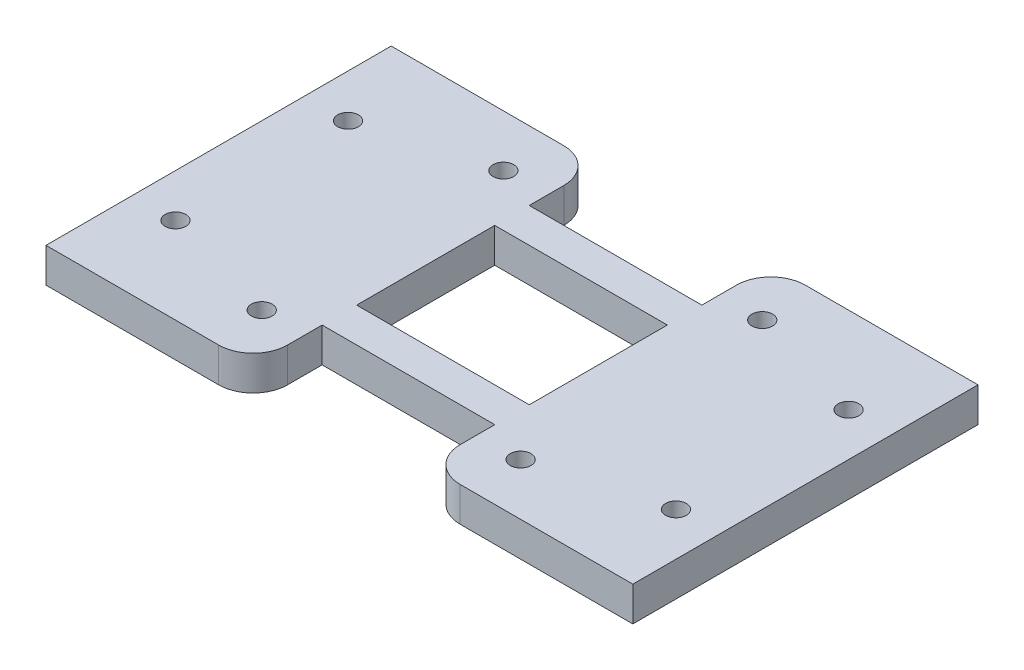
ISO-10303-21;
HEADER;
FILE_DESCRIPTION(('STEP AP214'),'2;1');
FILE_NAME('part.step','',(''),(''),'','','');
FILE_SCHEMA(('AUTOMOTIVE_DESIGN { 1 0 10303 214 1 1 1 1 }'));
ENDSEC;
DATA;
#1=APPLICATION_CONTEXT('core data for automotive mechanical design processes');
#2=APPLICATION_PROTOCOL_DEFINITION('international standard','automotive_design',2000,#1);
#3=PRODUCT_CONTEXT('',#1,'mechanical');
#4=PRODUCT('Part','Part','',(#3));
#5=PRODUCT_RELATED_PRODUCT_CATEGORY('part','',(#4));
#6=PRODUCT_DEFINITION_FORMATION('','',#4);
#7=PRODUCT_DEFINITION_CONTEXT('part definition',#1,'design');
#8=PRODUCT_DEFINITION('design','',#6,#7);
#9=PRODUCT_DEFINITION_SHAPE('','',#8);
#10=(LENGTH_UNIT() NAMED_UNIT(*) SI_UNIT(.MILLI.,.METRE.));
#11=(NAMED_UNIT(*) PLANE_ANGLE_UNIT() SI_UNIT($,.RADIAN.));
#12=(NAMED_UNIT(*) SI_UNIT($,.STERADIAN.) SOLID_ANGLE_UNIT());
#13=UNCERTAINTY_MEASURE_WITH_UNIT(LENGTH_MEASURE(1.E-05),#10,'distance_accuracy_value','');
#14=(GEOMETRIC_REPRESENTATION_CONTEXT(3) GLOBAL_UNCERTAINTY_ASSIGNED_CONTEXT((#13)) GLOBAL_UNIT_ASSIGNED_CONTEXT((#10,
#11,#12)) REPRESENTATION_CONTEXT('',''));
#15=CARTESIAN_POINT('',(0.,0.,0.));
#16=DIRECTION('',(0.,0.,1.));
#17=DIRECTION('',(1.,0.,0.));
#18=AXIS2_PLACEMENT_3D('',#15,#16,#17);
#19=CARTESIAN_POINT('',(17.,-2.,10.));
#20=DIRECTION('',(0.,1.,0.));
#21=DIRECTION('',(-1.,0.,0.));
#22=AXIS2_PLACEMENT_3D('',#19,#20,#21);
#23=PLANE('',#22);
#24=CARTESIAN_POINT('',(-7.5,-2.,-7.));
#25=DIRECTION('',(0.,-1.,0.));
#26=DIRECTION('',(-1.,0.,0.));
#27=AXIS2_PLACEMENT_3D('',#24,#25,#26);
#28=CIRCLE('',#27,0.6);
#29=CARTESIAN_POINT('',(-8.1,-2.,-7.));
#30=VERTEX_POINT('',#29);
#31=EDGE_CURVE('E658',#30,#30,#28,.T.);
#32=ORIENTED_EDGE('',*,*,#31,.F.);
#33=EDGE_LOOP('',(#32));
#34=FACE_BOUND('',#33,.T.);
#35=CARTESIAN_POINT('',(-14.5,-2.,-5.));
#36=DIRECTION('',(0.,-1.,0.));
#37=DIRECTION('',(-1.,0.,0.));
#38=AXIS2_PLACEMENT_3D('',#35,#36,#37);
#39=CIRCLE('',#38,0.6);
#40=CARTESIAN_POINT('',(-15.1,-2.,-5.));
#41=VERTEX_POINT('',#40);
#42=EDGE_CURVE('E660',#41,#41,#39,.T.);
#43=ORIENTED_EDGE('',*,*,#42,.F.);
#44=EDGE_LOOP('',(#43));
#45=FACE_BOUND('',#44,.T.);
#46=CARTESIAN_POINT('',(-14.5,-2.,5.));
#47=DIRECTION('',(0.,-1.,0.));
#48=DIRECTION('',(1.,0.,0.));
#49=AXIS2_PLACEMENT_3D('',#46,#47,#48);
#50=CIRCLE('',#49,0.6);
#51=CARTESIAN_POINT('',(-13.9,-2.,5.));
#52=VERTEX_POINT('',#51);
#53=EDGE_CURVE('E666',#52,#52,#50,.T.);
#54=ORIENTED_EDGE('',*,*,#53,.F.);
#55=EDGE_LOOP('',(#54));
#56=FACE_BOUND('',#55,.T.);
#57=CARTESIAN_POINT('',(-7.5,-2.,7.));
#58=DIRECTION('',(0.,-1.,0.));
#59=DIRECTION('',(1.,0.,0.));
#60=AXIS2_PLACEMENT_3D('',#57,#58,#59);
#61=CIRCLE('',#60,0.6);
#62=CARTESIAN_POINT('',(-6.9,-2.,7.));
#63=VERTEX_POINT('',#62);
#64=EDGE_CURVE('E354',#63,#63,#61,.T.);
#65=ORIENTED_EDGE('',*,*,#64,.F.);
#66=EDGE_LOOP('',(#65));
#67=FACE_BOUND('',#66,.T.);
#68=CARTESIAN_POINT('',(14.5,-2.,5.));
#69=DIRECTION('',(0.,1.,0.));
#70=DIRECTION('',(1.,0.,0.));
#71=AXIS2_PLACEMENT_3D('',#68,#69,#70);
#72=CIRCLE('',#71,0.6);
#73=CARTESIAN_POINT('',(15.1,-2.,5.));
#74=VERTEX_POINT('',#73);
#75=EDGE_CURVE('E351',#74,#74,#72,.T.);
#76=ORIENTED_EDGE('',*,*,#75,.T.);
#77=EDGE_LOOP('',(#76));
#78=FACE_BOUND('',#77,.T.);
#79=CARTESIAN_POINT('',(7.5,-2.,-7.));
#80=DIRECTION('',(0.,1.,0.));
#81=DIRECTION('',(-1.,0.,0.));
#82=AXIS2_PLACEMENT_3D('',#79,#80,#81);
#83=CIRCLE('',#82,0.600000000000001);
#84=CARTESIAN_POINT('',(6.9,-2.,-7.));
#85=VERTEX_POINT('',#84);
#86=EDGE_CURVE('E202',#85,#85,#83,.T.);
#87=ORIENTED_EDGE('',*,*,#86,.T.);
#88=EDGE_LOOP('',(#87));
#89=FACE_BOUND('',#88,.T.);
#90=DIRECTION('',(1.,0.,0.));
#91=VECTOR('',#90,1.);
#92=CARTESIAN_POINT('',(-17.,-2.,-10.));
#93=LINE('',#92,#91);
#94=CARTESIAN_POINT('',(-17.,-2.,-10.));
#95=VERTEX_POINT('',#94);
#96=CARTESIAN_POINT('',(-7.,-2.,-10.));
#97=VERTEX_POINT('',#96);
#98=EDGE_CURVE('E216',#95,#97,#93,.T.);
#99=ORIENTED_EDGE('',*,*,#98,.T.);
#100=CARTESIAN_POINT('',(-7.,-2.,-8.));
#101=DIRECTION('',(0.,1.,0.));
#102=DIRECTION('',(-1.,0.,0.));
#103=AXIS2_PLACEMENT_3D('',#100,#101,#102);
#104=CIRCLE('',#103,2.);
#105=CARTESIAN_POINT('',(-5.,-2.,-8.));
#106=VERTEX_POINT('',#105);
#107=EDGE_CURVE('E316',#97,#106,#104,.F.);
#108=ORIENTED_EDGE('',*,*,#107,.T.);
#109=DIRECTION('',(0.,0.,-1.));
#110=VECTOR('',#109,1.);
#111=CARTESIAN_POINT('',(-5.,-2.,10.));
#112=LINE('',#111,#110);
#113=CARTESIAN_POINT('',(-5.,-2.,-6.));
#114=VERTEX_POINT('',#113);
#115=EDGE_CURVE('E235',#114,#106,#112,.T.);
#116=ORIENTED_EDGE('',*,*,#115,.F.);
#117=DIRECTION('',(-1.,0.,0.));
#118=VECTOR('',#117,1.);
#119=CARTESIAN_POINT('',(6.,-2.,-6.));
#120=LINE('',#119,#118);
#121=CARTESIAN_POINT('',(5.,-2.,-6.));
#122=VERTEX_POINT('',#121);
#123=EDGE_CURVE('E241',#122,#114,#120,.T.);
#124=ORIENTED_EDGE('',*,*,#123,.F.);
#125=DIRECTION('',(0.,0.,-1.));
#126=VECTOR('',#125,1.);
#127=CARTESIAN_POINT('',(5.,-2.,10.));
#128=LINE('',#127,#126);
#129=CARTESIAN_POINT('',(5.,-2.,-8.));
#130=VERTEX_POINT('',#129);
#131=EDGE_CURVE('E281',#122,#130,#128,.T.);
#132=ORIENTED_EDGE('',*,*,#131,.T.);
#133=CARTESIAN_POINT('',(7.,-2.,-8.));
#134=DIRECTION('',(0.,1.,0.));
#135=DIRECTION('',(-1.,0.,0.));
#136=AXIS2_PLACEMENT_3D('',#133,#134,#135);
#137=CIRCLE('',#136,2.);
#138=CARTESIAN_POINT('',(7.,-2.,-10.));
#139=VERTEX_POINT('',#138);
#140=EDGE_CURVE('E291',#130,#139,#137,.F.);
#141=ORIENTED_EDGE('',*,*,#140,.T.);
#142=DIRECTION('',(1.,0.,0.));
#143=VECTOR('',#142,1.);
#144=CARTESIAN_POINT('',(17.,-2.,-10.));
#145=LINE('',#144,#143);
#146=CARTESIAN_POINT('',(17.,-2.,-10.));
#147=VERTEX_POINT('',#146);
#148=EDGE_CURVE('E258',#139,#147,#145,.T.);
#149=ORIENTED_EDGE('',*,*,#148,.T.);
#150=DIRECTION('',(0.,0.,-1.));
#151=VECTOR('',#150,1.);
#152=CARTESIAN_POINT('',(17.,-2.,10.));
#153=LINE('',#152,#151);
#154=CARTESIAN_POINT('',(17.,-2.,10.));
#155=VERTEX_POINT('',#154);
#156=EDGE_CURVE('E278',#155,#147,#153,.T.);
#157=ORIENTED_EDGE('',*,*,#156,.F.);
#158=DIRECTION('',(1.,0.,0.));
#159=VECTOR('',#158,1.);
#160=CARTESIAN_POINT('',(17.,-2.,10.));
#161=LINE('',#160,#159);
#162=CARTESIAN_POINT('',(7.,-2.,10.));
#163=VERTEX_POINT('',#162);
#164=EDGE_CURVE('E259',#163,#155,#161,.T.);
#165=ORIENTED_EDGE('',*,*,#164,.F.);
#166=CARTESIAN_POINT('',(7.,-2.,8.));
#167=DIRECTION('',(0.,1.,0.));
#168=DIRECTION('',(-1.,0.,0.));
#169=AXIS2_PLACEMENT_3D('',#166,#167,#168);
#170=CIRCLE('',#169,2.);
#171=CARTESIAN_POINT('',(5.,-2.,8.));
#172=VERTEX_POINT('',#171);
#173=EDGE_CURVE('E293',#163,#172,#170,.F.);
#174=ORIENTED_EDGE('',*,*,#173,.T.);
#175=CARTESIAN_POINT('',(5.,-2.,6.));
#176=VERTEX_POINT('',#175);
#177=EDGE_CURVE('E282',#172,#176,#128,.T.);
#178=ORIENTED_EDGE('',*,*,#177,.T.);
#179=DIRECTION('',(-1.,0.,0.));
#180=VECTOR('',#179,1.);
#181=CARTESIAN_POINT('',(6.,-2.,6.));
#182=LINE('',#181,#180);
#183=CARTESIAN_POINT('',(-5.,-2.,6.));
#184=VERTEX_POINT('',#183);
#185=EDGE_CURVE('E199',#176,#184,#182,.T.);
#186=ORIENTED_EDGE('',*,*,#185,.T.);
#187=CARTESIAN_POINT('',(-5.,-2.,8.));
#188=VERTEX_POINT('',#187);
#189=EDGE_CURVE('E236',#188,#184,#112,.T.);
#190=ORIENTED_EDGE('',*,*,#189,.F.);
#191=CARTESIAN_POINT('',(-7.,-2.,8.));
#192=DIRECTION('',(0.,1.,0.));
#193=DIRECTION('',(-1.,0.,0.));
#194=AXIS2_PLACEMENT_3D('',#191,#192,#193);
#195=CIRCLE('',#194,2.);
#196=CARTESIAN_POINT('',(-7.,-2.,10.));
#197=VERTEX_POINT('',#196);
#198=EDGE_CURVE('E48',#188,#197,#195,.F.);
#199=ORIENTED_EDGE('',*,*,#198,.T.);
#200=DIRECTION('',(1.,0.,0.));
#201=VECTOR('',#200,1.);
#202=CARTESIAN_POINT('',(-17.,-2.,10.));
#203=LINE('',#202,#201);
#204=CARTESIAN_POINT('',(-17.,-2.,10.));
#205=VERTEX_POINT('',#204);
#206=EDGE_CURVE('E217',#205,#197,#203,.T.);
#207=ORIENTED_EDGE('',*,*,#206,.F.);
#208=DIRECTION('',(0.,0.,-1.));
#209=VECTOR('',#208,1.);
#210=CARTESIAN_POINT('',(-17.,-2.,10.));
#211=LINE('',#210,#209);
#212=EDGE_CURVE('E224',#205,#95,#211,.T.);
#213=ORIENTED_EDGE('',*,*,#212,.T.);
#214=EDGE_LOOP('',(#99,#108,#116,#124,#132,#141,#149,#157,#165,#174,#178,#186,#190,#199,#207,#213));
#215=FACE_BOUND('',#214,.T.);
#216=DIRECTION('',(-1.,0.,0.));
#217=VECTOR('',#216,1.);
#218=CARTESIAN_POINT('',(6.,-2.,4.));
#219=LINE('',#218,#217);
#220=CARTESIAN_POINT('',(5.,-2.,4.));
#221=VERTEX_POINT('',#220);
#222=CARTESIAN_POINT('',(-5.,-2.,4.));
#223=VERTEX_POINT('',#222);
#224=EDGE_CURVE('E190',#221,#223,#219,.T.);
#225=ORIENTED_EDGE('',*,*,#224,.F.);
#226=CARTESIAN_POINT('',(5.,-2.,-4.));
#227=VERTEX_POINT('',#226);
#228=EDGE_CURVE('E284',#221,#227,#128,.T.);
#229=ORIENTED_EDGE('',*,*,#228,.T.);
#230=DIRECTION('',(-1.,0.,0.));
#231=VECTOR('',#230,1.);
#232=CARTESIAN_POINT('',(6.,-2.,-4.));
#233=LINE('',#232,#231);
#234=CARTESIAN_POINT('',(-5.,-2.,-4.));
#235=VERTEX_POINT('',#234);
#236=EDGE_CURVE('E244',#227,#235,#233,.T.);
#237=ORIENTED_EDGE('',*,*,#236,.T.);
#238=EDGE_CURVE('E239',#223,#235,#112,.T.);
#239=ORIENTED_EDGE('',*,*,#238,.F.);
#240=EDGE_LOOP('',(#225,#229,#237,#239));
#241=FACE_BOUND('',#240,.T.);
#242=CARTESIAN_POINT('',(14.5,-2.,-5.));
#243=DIRECTION('',(0.,1.,0.));
#244=DIRECTION('',(-1.,0.,0.));
#245=AXIS2_PLACEMENT_3D('',#242,#243,#244);
#246=CIRCLE('',#245,0.6);
#247=CARTESIAN_POINT('',(13.9,-2.,-5.));
#248=VERTEX_POINT('',#247);
#249=EDGE_CURVE('E342',#248,#248,#246,.T.);
#250=ORIENTED_EDGE('',*,*,#249,.T.);
#251=EDGE_LOOP('',(#250));
#252=FACE_BOUND('',#251,.T.);
#253=CARTESIAN_POINT('',(7.5,-2.,7.));
#254=DIRECTION('',(0.,1.,0.));
#255=DIRECTION('',(1.,0.,0.));
#256=AXIS2_PLACEMENT_3D('',#253,#254,#255);
#257=CIRCLE('',#256,0.600000000000001);
#258=CARTESIAN_POINT('',(8.1,-2.,7.));
#259=VERTEX_POINT('',#258);
#260=EDGE_CURVE('E345',#259,#259,#257,.T.);
#261=ORIENTED_EDGE('',*,*,#260,.T.);
#262=EDGE_LOOP('',(#261));
#263=FACE_BOUND('',#262,.T.);
#264=ADVANCED_FACE('F33',(#34,#45,#56,#67,#78,#89,#215,#241,#252,#263),#23,.F.);
#265=CARTESIAN_POINT('',(5.,0.,10.));
#266=DIRECTION('',(0.,-1.,0.));
#267=DIRECTION('',(1.,0.,0.));
#268=AXIS2_PLACEMENT_3D('',#265,#266,#267);
#269=PLANE('',#268);
#270=CARTESIAN_POINT('',(-7.5,0.,-7.));
#271=DIRECTION('',(0.,-1.,0.));
#272=DIRECTION('',(-1.,0.,0.));
#273=AXIS2_PLACEMENT_3D('',#270,#271,#272);
#274=CIRCLE('',#273,0.6);
#275=CARTESIAN_POINT('',(-8.1,0.,-7.));
#276=VERTEX_POINT('',#275);
#277=EDGE_CURVE('E655',#276,#276,#274,.T.);
#278=ORIENTED_EDGE('',*,*,#277,.T.);
#279=EDGE_LOOP('',(#278));
#280=FACE_BOUND('',#279,.T.);
#281=CARTESIAN_POINT('',(-14.5,0.,-5.));
#282=DIRECTION('',(0.,-1.,0.));
#283=DIRECTION('',(-1.,0.,0.));
#284=AXIS2_PLACEMENT_3D('',#281,#282,#283);
#285=CIRCLE('',#284,0.6);
#286=CARTESIAN_POINT('',(-15.1,0.,-5.));
#287=VERTEX_POINT('',#286);
#288=EDGE_CURVE('E663',#287,#287,#285,.T.);
#289=ORIENTED_EDGE('',*,*,#288,.T.);
#290=EDGE_LOOP('',(#289));
#291=FACE_BOUND('',#290,.T.);
#292=CARTESIAN_POINT('',(-14.5,0.,5.));
#293=DIRECTION('',(0.,-1.,0.));
#294=DIRECTION('',(1.,0.,0.));
#295=AXIS2_PLACEMENT_3D('',#292,#293,#294);
#296=CIRCLE('',#295,0.6);
#297=CARTESIAN_POINT('',(-13.9,0.,5.));
#298=VERTEX_POINT('',#297);
#299=EDGE_CURVE('E669',#298,#298,#296,.T.);
#300=ORIENTED_EDGE('',*,*,#299,.T.);
#301=EDGE_LOOP('',(#300));
#302=FACE_BOUND('',#301,.T.);
#303=CARTESIAN_POINT('',(-7.5,0.,7.));
#304=DIRECTION('',(0.,-1.,0.));
#305=DIRECTION('',(1.,0.,0.));
#306=AXIS2_PLACEMENT_3D('',#303,#304,#305);
#307=CIRCLE('',#306,0.6);
#308=CARTESIAN_POINT('',(-6.9,0.,7.));
#309=VERTEX_POINT('',#308);
#310=EDGE_CURVE('E348',#309,#309,#307,.T.);
#311=ORIENTED_EDGE('',*,*,#310,.T.);
#312=EDGE_LOOP('',(#311));
#313=FACE_BOUND('',#312,.T.);
#314=CARTESIAN_POINT('',(14.5,0.,5.));
#315=DIRECTION('',(0.,1.,0.));
#316=DIRECTION('',(1.,0.,0.));
#317=AXIS2_PLACEMENT_3D('',#314,#315,#316);
#318=CIRCLE('',#317,0.6);
#319=CARTESIAN_POINT('',(15.1,0.,5.));
#320=VERTEX_POINT('',#319);
#321=EDGE_CURVE('E358',#320,#320,#318,.T.);
#322=ORIENTED_EDGE('',*,*,#321,.F.);
#323=EDGE_LOOP('',(#322));
#324=FACE_BOUND('',#323,.T.);
#325=CARTESIAN_POINT('',(7.5,0.,-7.));
#326=DIRECTION('',(0.,1.,0.));
#327=DIRECTION('',(-1.,0.,0.));
#328=AXIS2_PLACEMENT_3D('',#325,#326,#327);
#329=CIRCLE('',#328,0.600000000000001);
#330=CARTESIAN_POINT('',(6.9,0.,-7.));
#331=VERTEX_POINT('',#330);
#332=EDGE_CURVE('E197',#331,#331,#329,.T.);
#333=ORIENTED_EDGE('',*,*,#332,.F.);
#334=EDGE_LOOP('',(#333));
#335=FACE_BOUND('',#334,.T.);
#336=DIRECTION('',(0.,0.,-1.));
#337=VECTOR('',#336,1.);
#338=CARTESIAN_POINT('',(5.,0.,10.));
#339=LINE('',#338,#337);
#340=CARTESIAN_POINT('',(5.,0.,4.));
#341=VERTEX_POINT('',#340);
#342=CARTESIAN_POINT('',(5.,0.,-4.));
#343=VERTEX_POINT('',#342);
#344=EDGE_CURVE('E196',#341,#343,#339,.T.);
#345=ORIENTED_EDGE('',*,*,#344,.F.);
#346=DIRECTION('',(-1.,0.,0.));
#347=VECTOR('',#346,1.);
#348=CARTESIAN_POINT('',(6.,0.,4.));
#349=LINE('',#348,#347);
#350=CARTESIAN_POINT('',(-5.,0.,4.));
#351=VERTEX_POINT('',#350);
#352=EDGE_CURVE('E188',#341,#351,#349,.T.);
#353=ORIENTED_EDGE('',*,*,#352,.T.);
#354=DIRECTION('',(0.,0.,-1.));
#355=VECTOR('',#354,1.);
#356=CARTESIAN_POINT('',(-5.,0.,10.));
#357=LINE('',#356,#355);
#358=CARTESIAN_POINT('',(-5.,0.,-4.));
#359=VERTEX_POINT('',#358);
#360=EDGE_CURVE('E169',#351,#359,#357,.T.);
#361=ORIENTED_EDGE('',*,*,#360,.T.);
#362=DIRECTION('',(-1.,0.,0.));
#363=VECTOR('',#362,1.);
#364=CARTESIAN_POINT('',(6.,0.,-4.));
#365=LINE('',#364,#363);
#366=EDGE_CURVE('E247',#343,#359,#365,.T.);
#367=ORIENTED_EDGE('',*,*,#366,.F.);
#368=EDGE_LOOP('',(#345,#353,#361,#367));
#369=FACE_BOUND('',#368,.T.);
#370=CARTESIAN_POINT('',(-5.,0.,-6.));
#371=VERTEX_POINT('',#370);
#372=CARTESIAN_POINT('',(-5.,0.,-8.));
#373=VERTEX_POINT('',#372);
#374=EDGE_CURVE('E181',#371,#373,#357,.T.);
#375=ORIENTED_EDGE('',*,*,#374,.T.);
#376=CARTESIAN_POINT('',(-7.,0.,-8.));
#377=DIRECTION('',(0.,-1.,0.));
#378=DIRECTION('',(1.,0.,0.));
#379=AXIS2_PLACEMENT_3D('',#376,#377,#378);
#380=CIRCLE('',#379,2.);
#381=CARTESIAN_POINT('',(-7.,0.,-10.));
#382=VERTEX_POINT('',#381);
#383=EDGE_CURVE('E311',#373,#382,#380,.F.);
#384=ORIENTED_EDGE('',*,*,#383,.T.);
#385=DIRECTION('',(-1.,0.,0.));
#386=VECTOR('',#385,1.);
#387=CARTESIAN_POINT('',(-5.,0.,-10.));
#388=LINE('',#387,#386);
#389=CARTESIAN_POINT('',(-17.,0.,-10.));
#390=VERTEX_POINT('',#389);
#391=EDGE_CURVE('E227',#382,#390,#388,.T.);
#392=ORIENTED_EDGE('',*,*,#391,.T.);
#393=DIRECTION('',(0.,0.,-1.));
#394=VECTOR('',#393,1.);
#395=CARTESIAN_POINT('',(-17.,0.,10.));
#396=LINE('',#395,#394);
#397=CARTESIAN_POINT('',(-17.,0.,10.));
#398=VERTEX_POINT('',#397);
#399=EDGE_CURVE('E232',#398,#390,#396,.T.);
#400=ORIENTED_EDGE('',*,*,#399,.F.);
#401=DIRECTION('',(-1.,0.,0.));
#402=VECTOR('',#401,1.);
#403=CARTESIAN_POINT('',(-5.,0.,10.));
#404=LINE('',#403,#402);
#405=CARTESIAN_POINT('',(-7.,0.,10.));
#406=VERTEX_POINT('',#405);
#407=EDGE_CURVE('E219',#406,#398,#404,.T.);
#408=ORIENTED_EDGE('',*,*,#407,.F.);
#409=CARTESIAN_POINT('',(-7.,0.,8.));
#410=DIRECTION('',(0.,-1.,0.));
#411=DIRECTION('',(1.,0.,0.));
#412=AXIS2_PLACEMENT_3D('',#409,#410,#411);
#413=CIRCLE('',#412,2.);
#414=CARTESIAN_POINT('',(-5.,0.,8.));
#415=VERTEX_POINT('',#414);
#416=EDGE_CURVE('E309',#406,#415,#413,.F.);
#417=ORIENTED_EDGE('',*,*,#416,.T.);
#418=CARTESIAN_POINT('',(-5.,0.,6.));
#419=VERTEX_POINT('',#418);
#420=EDGE_CURVE('E180',#415,#419,#357,.T.);
#421=ORIENTED_EDGE('',*,*,#420,.T.);
#422=DIRECTION('',(-1.,0.,0.));
#423=VECTOR('',#422,1.);
#424=CARTESIAN_POINT('',(6.,0.,6.));
#425=LINE('',#424,#423);
#426=CARTESIAN_POINT('',(5.,0.,6.));
#427=VERTEX_POINT('',#426);
#428=EDGE_CURVE('E208',#427,#419,#425,.T.);
#429=ORIENTED_EDGE('',*,*,#428,.F.);
#430=CARTESIAN_POINT('',(5.,0.,8.));
#431=VERTEX_POINT('',#430);
#432=EDGE_CURVE('E273',#431,#427,#339,.T.);
#433=ORIENTED_EDGE('',*,*,#432,.F.);
#434=CARTESIAN_POINT('',(7.,0.,8.));
#435=DIRECTION('',(0.,-1.,0.));
#436=DIRECTION('',(1.,0.,0.));
#437=AXIS2_PLACEMENT_3D('',#434,#435,#436);
#438=CIRCLE('',#437,2.);
#439=CARTESIAN_POINT('',(7.,0.,10.));
#440=VERTEX_POINT('',#439);
#441=EDGE_CURVE('E299',#431,#440,#438,.F.);
#442=ORIENTED_EDGE('',*,*,#441,.T.);
#443=DIRECTION('',(-1.,0.,0.));
#444=VECTOR('',#443,1.);
#445=CARTESIAN_POINT('',(5.,0.,10.));
#446=LINE('',#445,#444);
#447=CARTESIAN_POINT('',(17.,0.,10.));
#448=VERTEX_POINT('',#447);
#449=EDGE_CURVE('E264',#448,#440,#446,.T.);
#450=ORIENTED_EDGE('',*,*,#449,.F.);
#451=DIRECTION('',(0.,0.,-1.));
#452=VECTOR('',#451,1.);
#453=CARTESIAN_POINT('',(17.,0.,10.));
#454=LINE('',#453,#452);
#455=CARTESIAN_POINT('',(17.,0.,-10.));
#456=VERTEX_POINT('',#455);
#457=EDGE_CURVE('E275',#448,#456,#454,.T.);
#458=ORIENTED_EDGE('',*,*,#457,.T.);
#459=DIRECTION('',(-1.,0.,0.));
#460=VECTOR('',#459,1.);
#461=CARTESIAN_POINT('',(5.,0.,-10.));
#462=LINE('',#461,#460);
#463=CARTESIAN_POINT('',(7.,0.,-10.));
#464=VERTEX_POINT('',#463);
#465=EDGE_CURVE('E262',#456,#464,#462,.T.);
#466=ORIENTED_EDGE('',*,*,#465,.T.);
#467=CARTESIAN_POINT('',(7.,0.,-8.));
#468=DIRECTION('',(0.,-1.,0.));
#469=DIRECTION('',(1.,0.,0.));
#470=AXIS2_PLACEMENT_3D('',#467,#468,#469);
#471=CIRCLE('',#470,2.);
#472=CARTESIAN_POINT('',(5.,0.,-8.));
#473=VERTEX_POINT('',#472);
#474=EDGE_CURVE('E297',#464,#473,#471,.F.);
#475=ORIENTED_EDGE('',*,*,#474,.T.);
#476=CARTESIAN_POINT('',(5.,0.,-6.));
#477=VERTEX_POINT('',#476);
#478=EDGE_CURVE('E267',#477,#473,#339,.T.);
#479=ORIENTED_EDGE('',*,*,#478,.F.);
#480=DIRECTION('',(-1.,0.,0.));
#481=VECTOR('',#480,1.);
#482=CARTESIAN_POINT('',(6.,0.,-6.));
#483=LINE('',#482,#481);
#484=EDGE_CURVE('E249',#477,#371,#483,.T.);
#485=ORIENTED_EDGE('',*,*,#484,.T.);
#486=EDGE_LOOP('',(#375,#384,#392,#400,#408,#417,#421,#429,#433,#442,#450,#458,#466,#475,#479,#485));
#487=FACE_BOUND('',#486,.T.);
#488=CARTESIAN_POINT('',(14.5,0.,-5.));
#489=DIRECTION('',(0.,1.,0.));
#490=DIRECTION('',(-1.,0.,0.));
#491=AXIS2_PLACEMENT_3D('',#488,#489,#490);
#492=CIRCLE('',#491,0.6);
#493=CARTESIAN_POINT('',(13.9,0.,-5.));
#494=VERTEX_POINT('',#493);
#495=EDGE_CURVE('E363',#494,#494,#492,.T.);
#496=ORIENTED_EDGE('',*,*,#495,.F.);
#497=EDGE_LOOP('',(#496));
#498=FACE_BOUND('',#497,.T.);
#499=CARTESIAN_POINT('',(7.5,0.,7.));
#500=DIRECTION('',(0.,1.,0.));
#501=DIRECTION('',(1.,0.,0.));
#502=AXIS2_PLACEMENT_3D('',#499,#500,#501);
#503=CIRCLE('',#502,0.600000000000001);
#504=CARTESIAN_POINT('',(8.1,0.,7.));
#505=VERTEX_POINT('',#504);
#506=EDGE_CURVE('E347',#505,#505,#503,.T.);
#507=ORIENTED_EDGE('',*,*,#506,.F.);
#508=EDGE_LOOP('',(#507));
#509=FACE_BOUND('',#508,.T.);
#510=ADVANCED_FACE('F194',(#280,#291,#302,#313,#324,#335,#369,#487,#498,#509),#269,.F.);
#511=CARTESIAN_POINT('',(5.,0.,10.));
#512=DIRECTION('',(1.,0.,0.));
#513=DIRECTION('',(0.,1.,0.));
#514=AXIS2_PLACEMENT_3D('',#511,#512,#513);
#515=PLANE('',#514);
#516=ORIENTED_EDGE('',*,*,#177,.F.);
#517=DIRECTION('',(0.,-1.,0.));
#518=VECTOR('',#517,1.);
#519=CARTESIAN_POINT('',(5.,0.,8.));
#520=LINE('',#519,#518);
#521=EDGE_CURVE('E295',#172,#431,#520,.F.);
#522=ORIENTED_EDGE('',*,*,#521,.T.);
#523=ORIENTED_EDGE('',*,*,#432,.T.);
#524=DIRECTION('',(0.,1.,0.));
#525=VECTOR('',#524,1.);
#526=CARTESIAN_POINT('',(5.,0.,6.));
#527=LINE('',#526,#525);
#528=EDGE_CURVE('E213',#176,#427,#527,.T.);
#529=ORIENTED_EDGE('',*,*,#528,.F.);
#530=EDGE_LOOP('',(#516,#522,#523,#529));
#531=FACE_BOUND('',#530,.T.);
#532=ADVANCED_FACE('F423',(#531),#515,.F.);
#533=DIRECTION('',(0.,-1.,0.));
#534=VECTOR('',#533,1.);
#535=CARTESIAN_POINT('',(5.,0.,4.));
#536=LINE('',#535,#534);
#537=EDGE_CURVE('E211',#341,#221,#536,.T.);
#538=ORIENTED_EDGE('',*,*,#537,.F.);
#539=ORIENTED_EDGE('',*,*,#344,.T.);
#540=DIRECTION('',(0.,1.,0.));
#541=VECTOR('',#540,1.);
#542=CARTESIAN_POINT('',(5.,0.,-4.));
#543=LINE('',#542,#541);
#544=EDGE_CURVE('E252',#227,#343,#543,.T.);
#545=ORIENTED_EDGE('',*,*,#544,.F.);
#546=ORIENTED_EDGE('',*,*,#228,.F.);
#547=EDGE_LOOP('',(#538,#539,#545,#546));
#548=FACE_BOUND('',#547,.T.);
#549=ADVANCED_FACE('F431',(#548),#515,.F.);
#550=CARTESIAN_POINT('',(-5.,-2.,10.));
#551=DIRECTION('',(-1.,0.,0.));
#552=DIRECTION('',(0.,-1.,0.));
#553=AXIS2_PLACEMENT_3D('',#550,#551,#552);
#554=PLANE('',#553);
#555=ORIENTED_EDGE('',*,*,#420,.F.);
#556=DIRECTION('',(0.,1.,0.));
#557=VECTOR('',#556,1.);
#558=CARTESIAN_POINT('',(-5.,-2.,8.));
#559=LINE('',#558,#557);
#560=EDGE_CURVE('E12',#415,#188,#559,.F.);
#561=ORIENTED_EDGE('',*,*,#560,.T.);
#562=ORIENTED_EDGE('',*,*,#189,.T.);
#563=DIRECTION('',(0.,-1.,0.));
#564=VECTOR('',#563,1.);
#565=CARTESIAN_POINT('',(-5.,-2.,6.));
#566=LINE('',#565,#564);
#567=EDGE_CURVE('E191',#419,#184,#566,.T.);
#568=ORIENTED_EDGE('',*,*,#567,.F.);
#569=EDGE_LOOP('',(#555,#561,#562,#568));
#570=FACE_BOUND('',#569,.T.);
#571=ADVANCED_FACE('F403',(#570),#554,.F.);
#572=DIRECTION('',(0.,1.,0.));
#573=VECTOR('',#572,1.);
#574=CARTESIAN_POINT('',(-5.,-2.,4.));
#575=LINE('',#574,#573);
#576=EDGE_CURVE('E172',#223,#351,#575,.T.);
#577=ORIENTED_EDGE('',*,*,#576,.F.);
#578=ORIENTED_EDGE('',*,*,#238,.T.);
#579=DIRECTION('',(0.,1.,0.));
#580=VECTOR('',#579,1.);
#581=CARTESIAN_POINT('',(-5.,0.,-4.));
#582=LINE('',#581,#580);
#583=EDGE_CURVE('E175',#235,#359,#582,.T.);
#584=ORIENTED_EDGE('',*,*,#583,.T.);
#585=ORIENTED_EDGE('',*,*,#360,.F.);
#586=EDGE_LOOP('',(#577,#578,#584,#585));
#587=FACE_BOUND('',#586,.T.);
#588=ADVANCED_FACE('F171',(#587),#554,.F.);
#589=CARTESIAN_POINT('',(6.,0.,-6.));
#590=DIRECTION('',(0.,0.,1.));
#591=DIRECTION('',(1.,0.,0.));
#592=AXIS2_PLACEMENT_3D('',#589,#590,#591);
#593=PLANE('',#592);
#594=DIRECTION('',(0.,-1.,0.));
#595=VECTOR('',#594,1.);
#596=CARTESIAN_POINT('',(-5.,0.,-6.));
#597=LINE('',#596,#595);
#598=EDGE_CURVE('E238',#371,#114,#597,.T.);
#599=ORIENTED_EDGE('',*,*,#598,.F.);
#600=ORIENTED_EDGE('',*,*,#484,.F.);
#601=DIRECTION('',(0.,-1.,0.));
#602=VECTOR('',#601,1.);
#603=CARTESIAN_POINT('',(5.,0.,-6.));
#604=LINE('',#603,#602);
#605=EDGE_CURVE('E255',#477,#122,#604,.T.);
#606=ORIENTED_EDGE('',*,*,#605,.T.);
#607=ORIENTED_EDGE('',*,*,#123,.T.);
#608=EDGE_LOOP('',(#599,#600,#606,#607));
#609=FACE_BOUND('',#608,.T.);
#610=ADVANCED_FACE('F408',(#609),#593,.F.);
#611=CARTESIAN_POINT('',(6.,0.,-4.));
#612=DIRECTION('',(0.,0.,-1.));
#613=DIRECTION('',(-1.,0.,0.));
#614=AXIS2_PLACEMENT_3D('',#611,#612,#613);
#615=PLANE('',#614);
#616=ORIENTED_EDGE('',*,*,#583,.F.);
#617=ORIENTED_EDGE('',*,*,#236,.F.);
#618=ORIENTED_EDGE('',*,*,#544,.T.);
#619=ORIENTED_EDGE('',*,*,#366,.T.);
#620=EDGE_LOOP('',(#616,#617,#618,#619));
#621=FACE_BOUND('',#620,.T.);
#622=ADVANCED_FACE('F404',(#621),#615,.F.);
#623=ORIENTED_EDGE('',*,*,#478,.T.);
#624=DIRECTION('',(0.,-1.,0.));
#625=VECTOR('',#624,1.);
#626=CARTESIAN_POINT('',(5.,-2.,-8.));
#627=LINE('',#626,#625);
#628=EDGE_CURVE('E301',#473,#130,#627,.T.);
#629=ORIENTED_EDGE('',*,*,#628,.T.);
#630=ORIENTED_EDGE('',*,*,#131,.F.);
#631=ORIENTED_EDGE('',*,*,#605,.F.);
#632=EDGE_LOOP('',(#623,#629,#630,#631));
#633=FACE_BOUND('',#632,.T.);
#634=ADVANCED_FACE('F407',(#633),#515,.F.);
#635=CARTESIAN_POINT('',(17.,0.,10.));
#636=DIRECTION('',(-1.,0.,0.));
#637=DIRECTION('',(0.,0.,1.));
#638=AXIS2_PLACEMENT_3D('',#635,#636,#637);
#639=PLANE('',#638);
#640=DIRECTION('',(0.,1.,0.));
#641=VECTOR('',#640,1.);
#642=CARTESIAN_POINT('',(17.,0.,-10.));
#643=LINE('',#642,#641);
#644=EDGE_CURVE('E269',#147,#456,#643,.T.);
#645=ORIENTED_EDGE('',*,*,#644,.T.);
#646=ORIENTED_EDGE('',*,*,#457,.F.);
#647=DIRECTION('',(0.,1.,0.));
#648=VECTOR('',#647,1.);
#649=CARTESIAN_POINT('',(17.,0.,10.));
#650=LINE('',#649,#648);
#651=EDGE_CURVE('E261',#155,#448,#650,.T.);
#652=ORIENTED_EDGE('',*,*,#651,.F.);
#653=ORIENTED_EDGE('',*,*,#156,.T.);
#654=EDGE_LOOP('',(#645,#646,#652,#653));
#655=FACE_BOUND('',#654,.T.);
#656=ADVANCED_FACE('F416',(#655),#639,.F.);
#657=CARTESIAN_POINT('',(0.,0.,10.));
#658=DIRECTION('',(0.,0.,-1.));
#659=DIRECTION('',(-1.,0.,0.));
#660=AXIS2_PLACEMENT_3D('',#657,#658,#659);
#661=PLANE('',#660);
#662=ORIENTED_EDGE('',*,*,#449,.T.);
#663=DIRECTION('',(0.,-1.,0.));
#664=VECTOR('',#663,1.);
#665=CARTESIAN_POINT('',(7.,0.,10.));
#666=LINE('',#665,#664);
#667=EDGE_CURVE('E288',#440,#163,#666,.T.);
#668=ORIENTED_EDGE('',*,*,#667,.T.);
#669=ORIENTED_EDGE('',*,*,#164,.T.);
#670=ORIENTED_EDGE('',*,*,#651,.T.);
#671=EDGE_LOOP('',(#662,#668,#669,#670));
#672=FACE_BOUND('',#671,.T.);
#673=ADVANCED_FACE('F413',(#672),#661,.F.);
#674=CARTESIAN_POINT('',(0.,0.,-10.));
#675=DIRECTION('',(0.,0.,-1.));
#676=DIRECTION('',(-1.,0.,0.));
#677=AXIS2_PLACEMENT_3D('',#674,#675,#676);
#678=PLANE('',#677);
#679=ORIENTED_EDGE('',*,*,#148,.F.);
#680=DIRECTION('',(0.,-1.,0.));
#681=VECTOR('',#680,1.);
#682=CARTESIAN_POINT('',(7.,0.,-10.));
#683=LINE('',#682,#681);
#684=EDGE_CURVE('E304',#139,#464,#683,.F.);
#685=ORIENTED_EDGE('',*,*,#684,.T.);
#686=ORIENTED_EDGE('',*,*,#465,.F.);
#687=ORIENTED_EDGE('',*,*,#644,.F.);
#688=EDGE_LOOP('',(#679,#685,#686,#687));
#689=FACE_BOUND('',#688,.T.);
#690=ADVANCED_FACE('F401',(#689),#678,.T.);
#691=ORIENTED_EDGE('',*,*,#115,.T.);
#692=DIRECTION('',(0.,1.,0.));
#693=VECTOR('',#692,1.);
#694=CARTESIAN_POINT('',(-5.,-2.,-8.));
#695=LINE('',#694,#693);
#696=EDGE_CURVE('E306',#106,#373,#695,.T.);
#697=ORIENTED_EDGE('',*,*,#696,.T.);
#698=ORIENTED_EDGE('',*,*,#374,.F.);
#699=ORIENTED_EDGE('',*,*,#598,.T.);
#700=EDGE_LOOP('',(#691,#697,#698,#699));
#701=FACE_BOUND('',#700,.T.);
#702=ADVANCED_FACE('F398',(#701),#554,.F.);
#703=CARTESIAN_POINT('',(-17.,0.,10.));
#704=DIRECTION('',(1.,0.,0.));
#705=DIRECTION('',(0.,0.,-1.));
#706=AXIS2_PLACEMENT_3D('',#703,#704,#705);
#707=PLANE('',#706);
#708=DIRECTION('',(0.,-1.,0.));
#709=VECTOR('',#708,1.);
#710=CARTESIAN_POINT('',(-17.,0.,-10.));
#711=LINE('',#710,#709);
#712=EDGE_CURVE('E220',#390,#95,#711,.T.);
#713=ORIENTED_EDGE('',*,*,#712,.T.);
#714=ORIENTED_EDGE('',*,*,#212,.F.);
#715=DIRECTION('',(0.,-1.,0.));
#716=VECTOR('',#715,1.);
#717=CARTESIAN_POINT('',(-17.,0.,10.));
#718=LINE('',#717,#716);
#719=EDGE_CURVE('E222',#398,#205,#718,.T.);
#720=ORIENTED_EDGE('',*,*,#719,.F.);
#721=ORIENTED_EDGE('',*,*,#399,.T.);
#722=EDGE_LOOP('',(#713,#714,#720,#721));
#723=FACE_BOUND('',#722,.T.);
#724=ADVANCED_FACE('F331',(#723),#707,.F.);
#725=CARTESIAN_POINT('',(0.,0.,10.));
#726=DIRECTION('',(0.,0.,1.));
#727=DIRECTION('',(1.,0.,0.));
#728=AXIS2_PLACEMENT_3D('',#725,#726,#727);
#729=PLANE('',#728);
#730=ORIENTED_EDGE('',*,*,#206,.T.);
#731=DIRECTION('',(0.,1.,0.));
#732=VECTOR('',#731,1.);
#733=CARTESIAN_POINT('',(-7.,0.,10.));
#734=LINE('',#733,#732);
#735=EDGE_CURVE('E41',#197,#406,#734,.T.);
#736=ORIENTED_EDGE('',*,*,#735,.T.);
#737=ORIENTED_EDGE('',*,*,#407,.T.);
#738=ORIENTED_EDGE('',*,*,#719,.T.);
#739=EDGE_LOOP('',(#730,#736,#737,#738));
#740=FACE_BOUND('',#739,.T.);
#741=ADVANCED_FACE('F321',(#740),#729,.T.);
#742=CARTESIAN_POINT('',(0.,0.,-10.));
#743=DIRECTION('',(0.,0.,1.));
#744=DIRECTION('',(1.,0.,0.));
#745=AXIS2_PLACEMENT_3D('',#742,#743,#744);
#746=PLANE('',#745);
#747=ORIENTED_EDGE('',*,*,#391,.F.);
#748=DIRECTION('',(0.,1.,0.));
#749=VECTOR('',#748,1.);
#750=CARTESIAN_POINT('',(-7.,0.,-10.));
#751=LINE('',#750,#749);
#752=EDGE_CURVE('E313',#382,#97,#751,.F.);
#753=ORIENTED_EDGE('',*,*,#752,.T.);
#754=ORIENTED_EDGE('',*,*,#98,.F.);
#755=ORIENTED_EDGE('',*,*,#712,.F.);
#756=EDGE_LOOP('',(#747,#753,#754,#755));
#757=FACE_BOUND('',#756,.T.);
#758=ADVANCED_FACE('F389',(#757),#746,.F.);
#759=CARTESIAN_POINT('',(6.,0.,6.));
#760=DIRECTION('',(0.,0.,-1.));
#761=DIRECTION('',(-1.,0.,0.));
#762=AXIS2_PLACEMENT_3D('',#759,#760,#761);
#763=PLANE('',#762);
#764=ORIENTED_EDGE('',*,*,#185,.F.);
#765=ORIENTED_EDGE('',*,*,#528,.T.);
#766=ORIENTED_EDGE('',*,*,#428,.T.);
#767=ORIENTED_EDGE('',*,*,#567,.T.);
#768=EDGE_LOOP('',(#764,#765,#766,#767));
#769=FACE_BOUND('',#768,.T.);
#770=ADVANCED_FACE('F383',(#769),#763,.F.);
#771=CARTESIAN_POINT('',(6.,0.,4.));
#772=DIRECTION('',(0.,0.,1.));
#773=DIRECTION('',(1.,0.,0.));
#774=AXIS2_PLACEMENT_3D('',#771,#772,#773);
#775=PLANE('',#774);
#776=ORIENTED_EDGE('',*,*,#352,.F.);
#777=ORIENTED_EDGE('',*,*,#537,.T.);
#778=ORIENTED_EDGE('',*,*,#224,.T.);
#779=ORIENTED_EDGE('',*,*,#576,.T.);
#780=EDGE_LOOP('',(#776,#777,#778,#779));
#781=FACE_BOUND('',#780,.T.);
#782=ADVANCED_FACE('F186',(#781),#775,.F.);
#783=CARTESIAN_POINT('',(7.5,0.,-7.));
#784=DIRECTION('',(0.,-1.,0.));
#785=DIRECTION('',(1.,0.,0.));
#786=AXIS2_PLACEMENT_3D('',#783,#784,#785);
#787=CYLINDRICAL_SURFACE('',#786,0.600000000000001);
#788=ORIENTED_EDGE('',*,*,#332,.T.);
#789=EDGE_LOOP('',(#788));
#790=FACE_BOUND('',#789,.T.);
#791=ORIENTED_EDGE('',*,*,#86,.F.);
#792=EDGE_LOOP('',(#791));
#793=FACE_BOUND('',#792,.T.);
#794=ADVANCED_FACE('F372',(#790,#793),#787,.F.);
#795=CARTESIAN_POINT('',(14.5,0.,-5.));
#796=DIRECTION('',(0.,-1.,0.));
#797=DIRECTION('',(1.,0.,0.));
#798=AXIS2_PLACEMENT_3D('',#795,#796,#797);
#799=CYLINDRICAL_SURFACE('',#798,0.6);
#800=ORIENTED_EDGE('',*,*,#495,.T.);
#801=EDGE_LOOP('',(#800));
#802=FACE_BOUND('',#801,.T.);
#803=ORIENTED_EDGE('',*,*,#249,.F.);
#804=EDGE_LOOP('',(#803));
#805=FACE_BOUND('',#804,.T.);
#806=ADVANCED_FACE('F374',(#802,#805),#799,.F.);
#807=CARTESIAN_POINT('',(14.5,0.,5.));
#808=DIRECTION('',(0.,-1.,0.));
#809=DIRECTION('',(1.,0.,0.));
#810=AXIS2_PLACEMENT_3D('',#807,#808,#809);
#811=CYLINDRICAL_SURFACE('',#810,0.6);
#812=ORIENTED_EDGE('',*,*,#321,.T.);
#813=EDGE_LOOP('',(#812));
#814=FACE_BOUND('',#813,.T.);
#815=ORIENTED_EDGE('',*,*,#75,.F.);
#816=EDGE_LOOP('',(#815));
#817=FACE_BOUND('',#816,.T.);
#818=ADVANCED_FACE('F381',(#814,#817),#811,.F.);
#819=CARTESIAN_POINT('',(7.5,0.,7.));
#820=DIRECTION('',(0.,-1.,0.));
#821=DIRECTION('',(1.,0.,0.));
#822=AXIS2_PLACEMENT_3D('',#819,#820,#821);
#823=CYLINDRICAL_SURFACE('',#822,0.600000000000001);
#824=ORIENTED_EDGE('',*,*,#506,.T.);
#825=EDGE_LOOP('',(#824));
#826=FACE_BOUND('',#825,.T.);
#827=ORIENTED_EDGE('',*,*,#260,.F.);
#828=EDGE_LOOP('',(#827));
#829=FACE_BOUND('',#828,.T.);
#830=ADVANCED_FACE('F603',(#826,#829),#823,.F.);
#831=CARTESIAN_POINT('',(-7.5,0.,7.));
#832=DIRECTION('',(0.,-1.,0.));
#833=DIRECTION('',(1.,0.,0.));
#834=AXIS2_PLACEMENT_3D('',#831,#832,#833);
#835=CYLINDRICAL_SURFACE('',#834,0.6);
#836=ORIENTED_EDGE('',*,*,#310,.F.);
#837=EDGE_LOOP('',(#836));
#838=FACE_BOUND('',#837,.T.);
#839=ORIENTED_EDGE('',*,*,#64,.T.);
#840=EDGE_LOOP('',(#839));
#841=FACE_BOUND('',#840,.T.);
#842=ADVANCED_FACE('F612',(#838,#841),#835,.F.);
#843=CARTESIAN_POINT('',(-14.5,0.,5.));
#844=DIRECTION('',(0.,-1.,0.));
#845=DIRECTION('',(1.,0.,0.));
#846=AXIS2_PLACEMENT_3D('',#843,#844,#845);
#847=CYLINDRICAL_SURFACE('',#846,0.6);
#848=ORIENTED_EDGE('',*,*,#299,.F.);
#849=EDGE_LOOP('',(#848));
#850=FACE_BOUND('',#849,.T.);
#851=ORIENTED_EDGE('',*,*,#53,.T.);
#852=EDGE_LOOP('',(#851));
#853=FACE_BOUND('',#852,.T.);
#854=ADVANCED_FACE('F622',(#850,#853),#847,.F.);
#855=CARTESIAN_POINT('',(-14.5,0.,-5.));
#856=DIRECTION('',(0.,-1.,0.));
#857=DIRECTION('',(1.,0.,0.));
#858=AXIS2_PLACEMENT_3D('',#855,#856,#857);
#859=CYLINDRICAL_SURFACE('',#858,0.6);
#860=ORIENTED_EDGE('',*,*,#288,.F.);
#861=EDGE_LOOP('',(#860));
#862=FACE_BOUND('',#861,.T.);
#863=ORIENTED_EDGE('',*,*,#42,.T.);
#864=EDGE_LOOP('',(#863));
#865=FACE_BOUND('',#864,.T.);
#866=ADVANCED_FACE('F632',(#862,#865),#859,.F.);
#867=CARTESIAN_POINT('',(-7.5,0.,-7.));
#868=DIRECTION('',(0.,-1.,0.));
#869=DIRECTION('',(1.,0.,0.));
#870=AXIS2_PLACEMENT_3D('',#867,#868,#869);
#871=CYLINDRICAL_SURFACE('',#870,0.6);
#872=ORIENTED_EDGE('',*,*,#277,.F.);
#873=EDGE_LOOP('',(#872));
#874=FACE_BOUND('',#873,.T.);
#875=ORIENTED_EDGE('',*,*,#31,.T.);
#876=EDGE_LOOP('',(#875));
#877=FACE_BOUND('',#876,.T.);
#878=ADVANCED_FACE('F436',(#874,#877),#871,.F.);
#879=CARTESIAN_POINT('',(7.,0.,8.));
#880=DIRECTION('',(0.,-1.,0.));
#881=DIRECTION('',(1.,0.,0.));
#882=AXIS2_PLACEMENT_3D('',#879,#880,#881);
#883=CYLINDRICAL_SURFACE('',#882,2.);
#884=ORIENTED_EDGE('',*,*,#441,.F.);
#885=ORIENTED_EDGE('',*,*,#521,.F.);
#886=ORIENTED_EDGE('',*,*,#173,.F.);
#887=ORIENTED_EDGE('',*,*,#667,.F.);
#888=EDGE_LOOP('',(#884,#885,#886,#887));
#889=FACE_BOUND('',#888,.T.);
#890=ADVANCED_FACE('F432',(#889),#883,.T.);
#891=CARTESIAN_POINT('',(7.,0.,-8.));
#892=DIRECTION('',(0.,1.,0.));
#893=DIRECTION('',(-1.,0.,0.));
#894=AXIS2_PLACEMENT_3D('',#891,#892,#893);
#895=CYLINDRICAL_SURFACE('',#894,2.);
#896=ORIENTED_EDGE('',*,*,#474,.F.);
#897=ORIENTED_EDGE('',*,*,#684,.F.);
#898=ORIENTED_EDGE('',*,*,#140,.F.);
#899=ORIENTED_EDGE('',*,*,#628,.F.);
#900=EDGE_LOOP('',(#896,#897,#898,#899));
#901=FACE_BOUND('',#900,.T.);
#902=ADVANCED_FACE('F435',(#901),#895,.T.);
#903=CARTESIAN_POINT('',(-7.,-2.,-8.));
#904=DIRECTION('',(0.,1.,0.));
#905=DIRECTION('',(-1.,0.,0.));
#906=AXIS2_PLACEMENT_3D('',#903,#904,#905);
#907=CYLINDRICAL_SURFACE('',#906,2.);
#908=ORIENTED_EDGE('',*,*,#107,.F.);
#909=ORIENTED_EDGE('',*,*,#752,.F.);
#910=ORIENTED_EDGE('',*,*,#383,.F.);
#911=ORIENTED_EDGE('',*,*,#696,.F.);
#912=EDGE_LOOP('',(#908,#909,#910,#911));
#913=FACE_BOUND('',#912,.T.);
#914=ADVANCED_FACE('F439',(#913),#907,.T.);
#915=CARTESIAN_POINT('',(-7.,0.,8.));
#916=DIRECTION('',(0.,-1.,0.));
#917=DIRECTION('',(1.,0.,0.));
#918=AXIS2_PLACEMENT_3D('',#915,#916,#917);
#919=CYLINDRICAL_SURFACE('',#918,2.);
#920=ORIENTED_EDGE('',*,*,#198,.F.);
#921=ORIENTED_EDGE('',*,*,#560,.F.);
#922=ORIENTED_EDGE('',*,*,#416,.F.);
#923=ORIENTED_EDGE('',*,*,#735,.F.);
#924=EDGE_LOOP('',(#920,#921,#922,#923));
#925=FACE_BOUND('',#924,.T.);
#926=ADVANCED_FACE('F35',(#925),#919,.T.);
#927=CLOSED_SHELL('',(#264,#510,#532,#549,#571,#588,#610,#622,#634,#656,#673,#690,#702,#724,
#741,#758,#770,#782,#794,#806,#818,#830,#842,#854,#866,#878,#890,#902,#914,#926));
#928=MANIFOLD_SOLID_BREP('B2',#927);
#929=ADVANCED_BREP_SHAPE_REPRESENTATION('',(#18,#928),#14);
#930=SHAPE_DEFINITION_REPRESENTATION(#9,#929);
ENDSEC;
END-ISO-10303-21;
